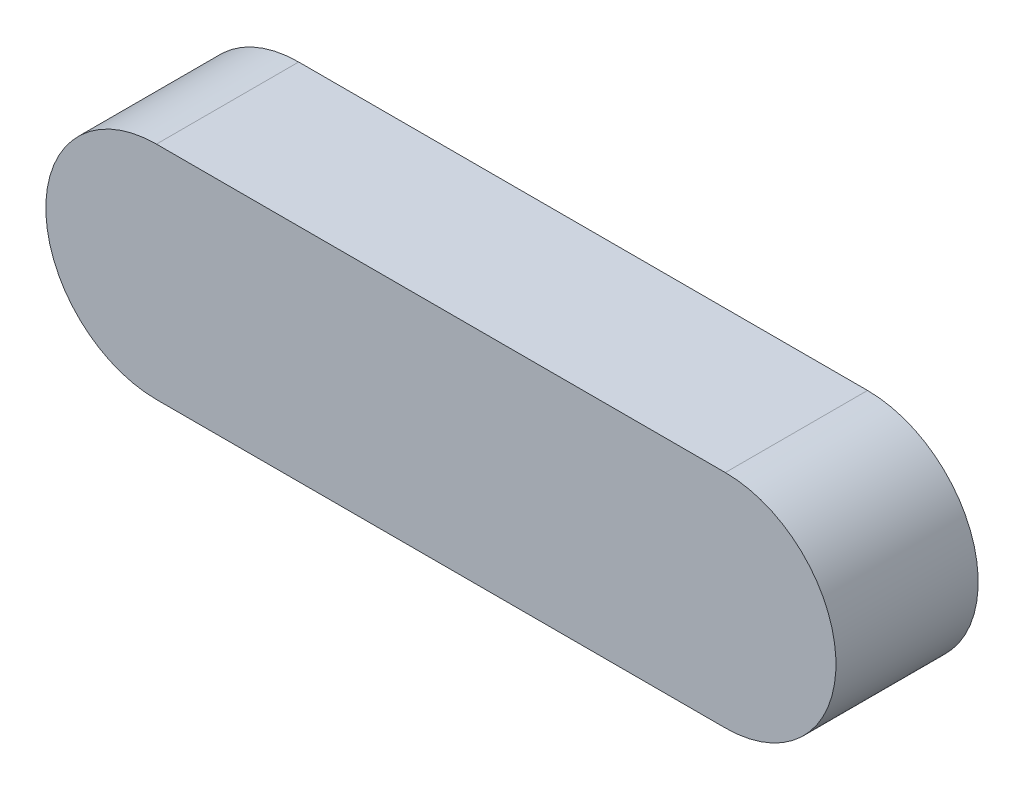
ISO-10303-21;
HEADER;
FILE_DESCRIPTION(('STEP AP214'),'2;1');
FILE_NAME('part.step','',(''),(''),'','','');
FILE_SCHEMA(('AUTOMOTIVE_DESIGN { 1 0 10303 214 1 1 1 1 }'));
ENDSEC;
DATA;
#1=APPLICATION_CONTEXT('core data for automotive mechanical design processes');
#2=APPLICATION_PROTOCOL_DEFINITION('international standard','automotive_design',2000,#1);
#3=PRODUCT_CONTEXT('',#1,'mechanical');
#4=PRODUCT('Part','Part','',(#3));
#5=PRODUCT_RELATED_PRODUCT_CATEGORY('part','',(#4));
#6=PRODUCT_DEFINITION_FORMATION('','',#4);
#7=PRODUCT_DEFINITION_CONTEXT('part definition',#1,'design');
#8=PRODUCT_DEFINITION('design','',#6,#7);
#9=PRODUCT_DEFINITION_SHAPE('','',#8);
#10=(LENGTH_UNIT() NAMED_UNIT(*) SI_UNIT(.MILLI.,.METRE.));
#11=(NAMED_UNIT(*) PLANE_ANGLE_UNIT() SI_UNIT($,.RADIAN.));
#12=(NAMED_UNIT(*) SI_UNIT($,.STERADIAN.) SOLID_ANGLE_UNIT());
#13=UNCERTAINTY_MEASURE_WITH_UNIT(LENGTH_MEASURE(1.E-05),#10,'distance_accuracy_value','');
#14=(GEOMETRIC_REPRESENTATION_CONTEXT(3) GLOBAL_UNCERTAINTY_ASSIGNED_CONTEXT((#13)) GLOBAL_UNIT_ASSIGNED_CONTEXT((#10,
#11,#12)) REPRESENTATION_CONTEXT('',''));
#15=CARTESIAN_POINT('',(0.,0.,0.));
#16=DIRECTION('',(0.,0.,1.));
#17=DIRECTION('',(1.,0.,0.));
#18=AXIS2_PLACEMENT_3D('',#15,#16,#17);
#19=CARTESIAN_POINT('',(0.,0.,9.));
#20=DIRECTION('',(0.,0.,-1.));
#21=DIRECTION('',(-1.,0.,0.));
#22=AXIS2_PLACEMENT_3D('',#19,#20,#21);
#23=CYLINDRICAL_SURFACE('',#22,7.);
#24=CARTESIAN_POINT('',(0.,0.,0.));
#25=DIRECTION('',(0.,0.,1.));
#26=DIRECTION('',(1.,0.,0.));
#27=AXIS2_PLACEMENT_3D('',#24,#25,#26);
#28=CIRCLE('',#27,7.);
#29=CARTESIAN_POINT('',(0.,7.,0.));
#30=VERTEX_POINT('',#29);
#31=CARTESIAN_POINT('',(0.,-7.,0.));
#32=VERTEX_POINT('',#31);
#33=EDGE_CURVE('E107',#30,#32,#28,.T.);
#34=ORIENTED_EDGE('',*,*,#33,.T.);
#35=DIRECTION('',(0.,0.,-1.));
#36=VECTOR('',#35,1.);
#37=CARTESIAN_POINT('',(0.,-7.,9.));
#38=LINE('',#37,#36);
#39=CARTESIAN_POINT('',(0.,-7.,9.));
#40=VERTEX_POINT('',#39);
#41=EDGE_CURVE('E11',#40,#32,#38,.T.);
#42=ORIENTED_EDGE('',*,*,#41,.F.);
#43=CARTESIAN_POINT('',(0.,0.,9.));
#44=DIRECTION('',(0.,0.,1.));
#45=DIRECTION('',(1.,0.,0.));
#46=AXIS2_PLACEMENT_3D('',#43,#44,#45);
#47=CIRCLE('',#46,7.);
#48=CARTESIAN_POINT('',(0.,7.,9.));
#49=VERTEX_POINT('',#48);
#50=EDGE_CURVE('E91',#49,#40,#47,.T.);
#51=ORIENTED_EDGE('',*,*,#50,.F.);
#52=DIRECTION('',(0.,0.,-1.));
#53=VECTOR('',#52,1.);
#54=CARTESIAN_POINT('',(0.,7.,9.));
#55=LINE('',#54,#53);
#56=EDGE_CURVE('E103',#49,#30,#55,.T.);
#57=ORIENTED_EDGE('',*,*,#56,.T.);
#58=EDGE_LOOP('',(#34,#42,#51,#57));
#59=FACE_BOUND('',#58,.T.);
#60=ADVANCED_FACE('F39',(#59),#23,.T.);
#61=CARTESIAN_POINT('',(0.,-7.,9.));
#62=DIRECTION('',(0.,1.,0.));
#63=DIRECTION('',(0.,0.,1.));
#64=AXIS2_PLACEMENT_3D('',#61,#62,#63);
#65=PLANE('',#64);
#66=DIRECTION('',(1.,0.,0.));
#67=VECTOR('',#66,1.);
#68=CARTESIAN_POINT('',(0.,-7.,0.));
#69=LINE('',#68,#67);
#70=CARTESIAN_POINT('',(36.,-7.,0.));
#71=VERTEX_POINT('',#70);
#72=EDGE_CURVE('E96',#32,#71,#69,.T.);
#73=ORIENTED_EDGE('',*,*,#72,.T.);
#74=DIRECTION('',(0.,0.,-1.));
#75=VECTOR('',#74,1.);
#76=CARTESIAN_POINT('',(36.,-7.,9.));
#77=LINE('',#76,#75);
#78=CARTESIAN_POINT('',(36.,-7.,9.));
#79=VERTEX_POINT('',#78);
#80=EDGE_CURVE('E48',#79,#71,#77,.T.);
#81=ORIENTED_EDGE('',*,*,#80,.F.);
#82=DIRECTION('',(1.,0.,0.));
#83=VECTOR('',#82,1.);
#84=CARTESIAN_POINT('',(0.,-7.,9.));
#85=LINE('',#84,#83);
#86=EDGE_CURVE('E86',#40,#79,#85,.T.);
#87=ORIENTED_EDGE('',*,*,#86,.F.);
#88=ORIENTED_EDGE('',*,*,#41,.T.);
#89=EDGE_LOOP('',(#73,#81,#87,#88));
#90=FACE_BOUND('',#89,.T.);
#91=ADVANCED_FACE('F95',(#90),#65,.F.);
#92=CARTESIAN_POINT('',(36.,0.,9.));
#93=DIRECTION('',(0.,0.,-1.));
#94=DIRECTION('',(-1.,0.,0.));
#95=AXIS2_PLACEMENT_3D('',#92,#93,#94);
#96=CYLINDRICAL_SURFACE('',#95,7.);
#97=CARTESIAN_POINT('',(36.,0.,0.));
#98=DIRECTION('',(0.,0.,1.));
#99=DIRECTION('',(1.,0.,0.));
#100=AXIS2_PLACEMENT_3D('',#97,#98,#99);
#101=CIRCLE('',#100,7.);
#102=CARTESIAN_POINT('',(36.,7.,0.));
#103=VERTEX_POINT('',#102);
#104=EDGE_CURVE('E73',#71,#103,#101,.T.);
#105=ORIENTED_EDGE('',*,*,#104,.T.);
#106=DIRECTION('',(0.,0.,-1.));
#107=VECTOR('',#106,1.);
#108=CARTESIAN_POINT('',(36.,7.,9.));
#109=LINE('',#108,#107);
#110=CARTESIAN_POINT('',(36.,7.,9.));
#111=VERTEX_POINT('',#110);
#112=EDGE_CURVE('E98',#111,#103,#109,.T.);
#113=ORIENTED_EDGE('',*,*,#112,.F.);
#114=CARTESIAN_POINT('',(36.,0.,9.));
#115=DIRECTION('',(0.,0.,1.));
#116=DIRECTION('',(1.,0.,0.));
#117=AXIS2_PLACEMENT_3D('',#114,#115,#116);
#118=CIRCLE('',#117,7.);
#119=EDGE_CURVE('E89',#79,#111,#118,.T.);
#120=ORIENTED_EDGE('',*,*,#119,.F.);
#121=ORIENTED_EDGE('',*,*,#80,.T.);
#122=EDGE_LOOP('',(#105,#113,#120,#121));
#123=FACE_BOUND('',#122,.T.);
#124=ADVANCED_FACE('F99',(#123),#96,.T.);
#125=CARTESIAN_POINT('',(0.,7.,9.));
#126=DIRECTION('',(0.,-1.,0.));
#127=DIRECTION('',(0.,0.,-1.));
#128=AXIS2_PLACEMENT_3D('',#125,#126,#127);
#129=PLANE('',#128);
#130=DIRECTION('',(-1.,0.,0.));
#131=VECTOR('',#130,1.);
#132=CARTESIAN_POINT('',(0.,7.,0.));
#133=LINE('',#132,#131);
#134=EDGE_CURVE('E79',#103,#30,#133,.T.);
#135=ORIENTED_EDGE('',*,*,#134,.T.);
#136=ORIENTED_EDGE('',*,*,#56,.F.);
#137=DIRECTION('',(-1.,0.,0.));
#138=VECTOR('',#137,1.);
#139=CARTESIAN_POINT('',(0.,7.,9.));
#140=LINE('',#139,#138);
#141=EDGE_CURVE('E56',#111,#49,#140,.T.);
#142=ORIENTED_EDGE('',*,*,#141,.F.);
#143=ORIENTED_EDGE('',*,*,#112,.T.);
#144=EDGE_LOOP('',(#135,#136,#142,#143));
#145=FACE_BOUND('',#144,.T.);
#146=ADVANCED_FACE('F120',(#145),#129,.F.);
#147=CARTESIAN_POINT('',(0.,0.,9.));
#148=DIRECTION('',(0.,0.,1.));
#149=DIRECTION('',(1.,0.,0.));
#150=AXIS2_PLACEMENT_3D('',#147,#148,#149);
#151=PLANE('',#150);
#152=ORIENTED_EDGE('',*,*,#50,.T.);
#153=ORIENTED_EDGE('',*,*,#86,.T.);
#154=ORIENTED_EDGE('',*,*,#119,.T.);
#155=ORIENTED_EDGE('',*,*,#141,.T.);
#156=EDGE_LOOP('',(#152,#153,#154,#155));
#157=FACE_BOUND('',#156,.T.);
#158=ADVANCED_FACE('F87',(#157),#151,.T.);
#159=CARTESIAN_POINT('',(0.,0.,0.));
#160=DIRECTION('',(0.,0.,1.));
#161=DIRECTION('',(1.,0.,0.));
#162=AXIS2_PLACEMENT_3D('',#159,#160,#161);
#163=PLANE('',#162);
#164=ORIENTED_EDGE('',*,*,#33,.F.);
#165=ORIENTED_EDGE('',*,*,#134,.F.);
#166=ORIENTED_EDGE('',*,*,#104,.F.);
#167=ORIENTED_EDGE('',*,*,#72,.F.);
#168=EDGE_LOOP('',(#164,#165,#166,#167));
#169=FACE_BOUND('',#168,.T.);
#170=ADVANCED_FACE('F123',(#169),#163,.F.);
#171=CLOSED_SHELL('',(#60,#91,#124,#146,#158,#170));
#172=MANIFOLD_SOLID_BREP('B2',#171);
#173=ADVANCED_BREP_SHAPE_REPRESENTATION('',(#18,#172),#14);
#174=SHAPE_DEFINITION_REPRESENTATION(#9,#173);
ENDSEC;
END-ISO-10303-21;
